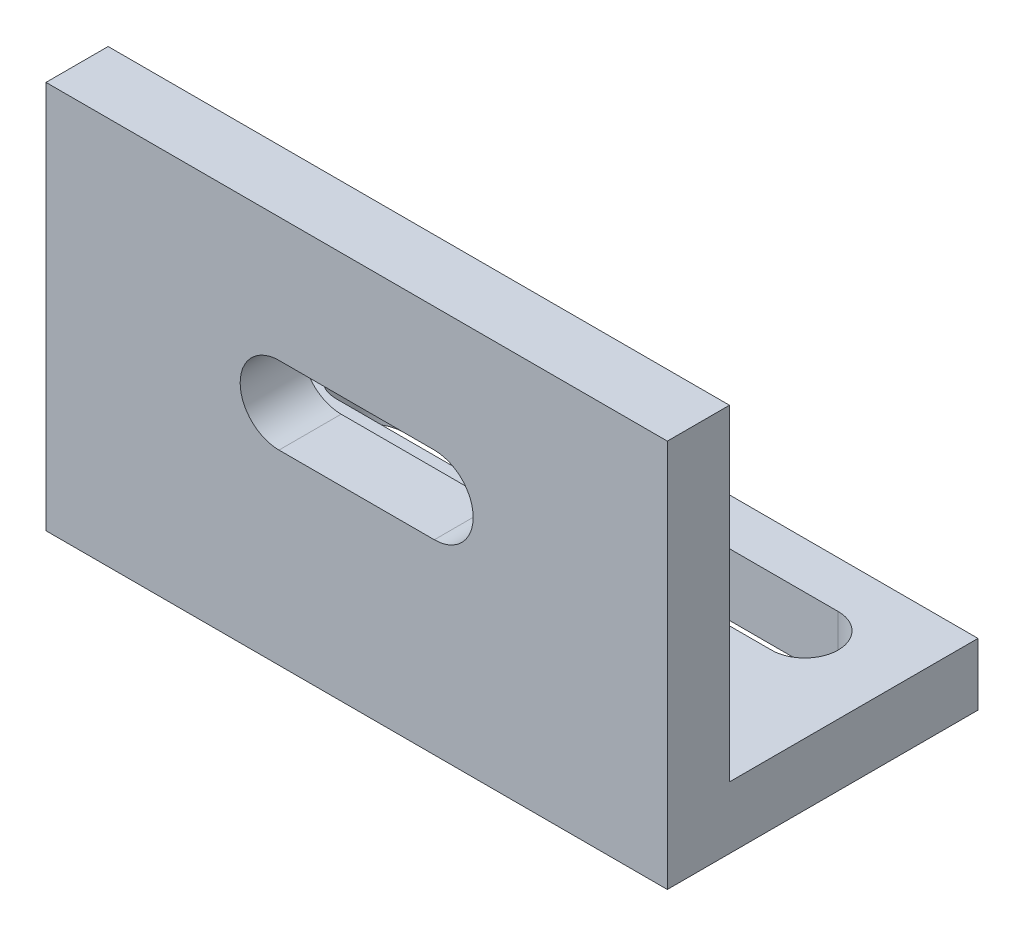
ISO-10303-21;
HEADER;
FILE_DESCRIPTION(('STEP AP214'),'2;1');
FILE_NAME('part.step','',(''),(''),'','','');
FILE_SCHEMA(('AUTOMOTIVE_DESIGN { 1 0 10303 214 1 1 1 1 }'));
ENDSEC;
DATA;
#1=APPLICATION_CONTEXT('core data for automotive mechanical design processes');
#2=APPLICATION_PROTOCOL_DEFINITION('international standard','automotive_design',2000,#1);
#3=PRODUCT_CONTEXT('',#1,'mechanical');
#4=PRODUCT('Part','Part','',(#3));
#5=PRODUCT_RELATED_PRODUCT_CATEGORY('part','',(#4));
#6=PRODUCT_DEFINITION_FORMATION('','',#4);
#7=PRODUCT_DEFINITION_CONTEXT('part definition',#1,'design');
#8=PRODUCT_DEFINITION('design','',#6,#7);
#9=PRODUCT_DEFINITION_SHAPE('','',#8);
#10=(LENGTH_UNIT() NAMED_UNIT(*) SI_UNIT(.MILLI.,.METRE.));
#11=(NAMED_UNIT(*) PLANE_ANGLE_UNIT() SI_UNIT($,.RADIAN.));
#12=(NAMED_UNIT(*) SI_UNIT($,.STERADIAN.) SOLID_ANGLE_UNIT());
#13=UNCERTAINTY_MEASURE_WITH_UNIT(LENGTH_MEASURE(1.E-05),#10,'distance_accuracy_value','');
#14=(GEOMETRIC_REPRESENTATION_CONTEXT(3) GLOBAL_UNCERTAINTY_ASSIGNED_CONTEXT((#13)) GLOBAL_UNIT_ASSIGNED_CONTEXT((#10,
#11,#12)) REPRESENTATION_CONTEXT('',''));
#15=CARTESIAN_POINT('',(0.,0.,0.));
#16=DIRECTION('',(0.,0.,1.));
#17=DIRECTION('',(1.,0.,0.));
#18=AXIS2_PLACEMENT_3D('',#15,#16,#17);
#19=CARTESIAN_POINT('',(-49.2592592592593,4.,0.));
#20=DIRECTION('',(1.,0.,0.));
#21=DIRECTION('',(0.,0.,-1.));
#22=AXIS2_PLACEMENT_3D('',#19,#20,#21);
#23=PLANE('',#22);
#24=DIRECTION('',(0.,0.,1.));
#25=VECTOR('',#24,1.);
#26=CARTESIAN_POINT('',(-49.2592592592593,0.,0.));
#27=LINE('',#26,#25);
#28=CARTESIAN_POINT('',(-49.2592592592593,0.,-12.8888888888889));
#29=VERTEX_POINT('',#28);
#30=CARTESIAN_POINT('',(-49.2592592592593,0.,7.1111111111111));
#31=VERTEX_POINT('',#30);
#32=EDGE_CURVE('E211',#29,#31,#27,.T.);
#33=ORIENTED_EDGE('',*,*,#32,.T.);
#34=DIRECTION('',(0.,-1.,0.));
#35=VECTOR('',#34,1.);
#36=CARTESIAN_POINT('',(-49.2592592592593,4.,7.1111111111111));
#37=LINE('',#36,#35);
#38=CARTESIAN_POINT('',(-49.2592592592593,25.,7.1111111111111));
#39=VERTEX_POINT('',#38);
#40=EDGE_CURVE('E237',#39,#31,#37,.T.);
#41=ORIENTED_EDGE('',*,*,#40,.F.);
#42=DIRECTION('',(0.,0.,1.));
#43=VECTOR('',#42,1.);
#44=CARTESIAN_POINT('',(-49.2592592592593,25.,7.1111111111111));
#45=LINE('',#44,#43);
#46=CARTESIAN_POINT('',(-49.2592592592593,25.,3.1111111111111));
#47=VERTEX_POINT('',#46);
#48=EDGE_CURVE('E193',#47,#39,#45,.T.);
#49=ORIENTED_EDGE('',*,*,#48,.F.);
#50=DIRECTION('',(0.,-1.,0.));
#51=VECTOR('',#50,1.);
#52=CARTESIAN_POINT('',(-49.2592592592593,25.,3.1111111111111));
#53=LINE('',#52,#51);
#54=CARTESIAN_POINT('',(-49.2592592592593,4.,3.1111111111111));
#55=VERTEX_POINT('',#54);
#56=EDGE_CURVE('E203',#47,#55,#53,.T.);
#57=ORIENTED_EDGE('',*,*,#56,.T.);
#58=DIRECTION('',(0.,0.,1.));
#59=VECTOR('',#58,1.);
#60=CARTESIAN_POINT('',(-49.2592592592593,4.,0.));
#61=LINE('',#60,#59);
#62=CARTESIAN_POINT('',(-49.2592592592593,4.,-12.8888888888889));
#63=VERTEX_POINT('',#62);
#64=EDGE_CURVE('E212',#63,#55,#61,.T.);
#65=ORIENTED_EDGE('',*,*,#64,.F.);
#66=DIRECTION('',(0.,-1.,0.));
#67=VECTOR('',#66,1.);
#68=CARTESIAN_POINT('',(-49.2592592592593,4.,-12.8888888888889));
#69=LINE('',#68,#67);
#70=EDGE_CURVE('E221',#63,#29,#69,.T.);
#71=ORIENTED_EDGE('',*,*,#70,.T.);
#72=EDGE_LOOP('',(#33,#41,#49,#57,#65,#71));
#73=FACE_BOUND('',#72,.T.);
#74=ADVANCED_FACE('F35',(#73),#23,.F.);
#75=CARTESIAN_POINT('',(0.,4.,7.1111111111111));
#76=DIRECTION('',(0.,0.,-1.));
#77=DIRECTION('',(-1.,0.,0.));
#78=AXIS2_PLACEMENT_3D('',#75,#76,#77);
#79=PLANE('',#78);
#80=DIRECTION('',(1.,0.,0.));
#81=VECTOR('',#80,1.);
#82=CARTESIAN_POINT('',(0.,17.,7.1111111111111));
#83=LINE('',#82,#81);
#84=CARTESIAN_POINT('',(-34.2592592592593,17.,7.1111111111111));
#85=VERTEX_POINT('',#84);
#86=CARTESIAN_POINT('',(-24.2592592592593,17.,7.1111111111111));
#87=VERTEX_POINT('',#86);
#88=EDGE_CURVE('E166',#85,#87,#83,.T.);
#89=ORIENTED_EDGE('',*,*,#88,.T.);
#90=CARTESIAN_POINT('',(-24.2592592592593,14.5,7.1111111111111));
#91=DIRECTION('',(0.,0.,-1.));
#92=DIRECTION('',(-1.,0.,0.));
#93=AXIS2_PLACEMENT_3D('',#90,#91,#92);
#94=CIRCLE('',#93,2.5);
#95=CARTESIAN_POINT('',(-24.2592592592593,12.,7.1111111111111));
#96=VERTEX_POINT('',#95);
#97=EDGE_CURVE('E169',#87,#96,#94,.T.);
#98=ORIENTED_EDGE('',*,*,#97,.T.);
#99=DIRECTION('',(-1.,0.,0.));
#100=VECTOR('',#99,1.);
#101=CARTESIAN_POINT('',(0.,12.,7.1111111111111));
#102=LINE('',#101,#100);
#103=CARTESIAN_POINT('',(-34.2592592592593,12.,7.1111111111111));
#104=VERTEX_POINT('',#103);
#105=EDGE_CURVE('E161',#96,#104,#102,.T.);
#106=ORIENTED_EDGE('',*,*,#105,.T.);
#107=CARTESIAN_POINT('',(-34.2592592592593,14.5,7.1111111111111));
#108=DIRECTION('',(0.,0.,-1.));
#109=DIRECTION('',(-1.,0.,0.));
#110=AXIS2_PLACEMENT_3D('',#107,#108,#109);
#111=CIRCLE('',#110,2.5);
#112=EDGE_CURVE('E141',#104,#85,#111,.T.);
#113=ORIENTED_EDGE('',*,*,#112,.T.);
#114=EDGE_LOOP('',(#89,#98,#106,#113));
#115=FACE_BOUND('',#114,.T.);
#116=DIRECTION('',(1.,0.,0.));
#117=VECTOR('',#116,1.);
#118=CARTESIAN_POINT('',(0.,0.,7.1111111111111));
#119=LINE('',#118,#117);
#120=CARTESIAN_POINT('',(-9.25925925925926,0.,7.1111111111111));
#121=VERTEX_POINT('',#120);
#122=EDGE_CURVE('E224',#31,#121,#119,.T.);
#123=ORIENTED_EDGE('',*,*,#122,.T.);
#124=DIRECTION('',(0.,-1.,0.));
#125=VECTOR('',#124,1.);
#126=CARTESIAN_POINT('',(-9.25925925925926,4.,7.1111111111111));
#127=LINE('',#126,#125);
#128=CARTESIAN_POINT('',(-9.25925925925926,25.,7.1111111111111));
#129=VERTEX_POINT('',#128);
#130=EDGE_CURVE('E235',#129,#121,#127,.T.);
#131=ORIENTED_EDGE('',*,*,#130,.F.);
#132=DIRECTION('',(1.,0.,0.));
#133=VECTOR('',#132,1.);
#134=CARTESIAN_POINT('',(-49.2592592592593,25.,7.1111111111111));
#135=LINE('',#134,#133);
#136=EDGE_CURVE('E196',#39,#129,#135,.T.);
#137=ORIENTED_EDGE('',*,*,#136,.F.);
#138=ORIENTED_EDGE('',*,*,#40,.T.);
#139=EDGE_LOOP('',(#123,#131,#137,#138));
#140=FACE_BOUND('',#139,.T.);
#141=ADVANCED_FACE('F280',(#115,#140),#79,.F.);
#142=CARTESIAN_POINT('',(-9.25925925925926,4.,0.));
#143=DIRECTION('',(1.,0.,0.));
#144=DIRECTION('',(0.,0.,-1.));
#145=AXIS2_PLACEMENT_3D('',#142,#143,#144);
#146=PLANE('',#145);
#147=DIRECTION('',(0.,0.,1.));
#148=VECTOR('',#147,1.);
#149=CARTESIAN_POINT('',(-9.25925925925926,0.,0.));
#150=LINE('',#149,#148);
#151=CARTESIAN_POINT('',(-9.25925925925926,0.,-12.8888888888889));
#152=VERTEX_POINT('',#151);
#153=EDGE_CURVE('E227',#152,#121,#150,.T.);
#154=ORIENTED_EDGE('',*,*,#153,.F.);
#155=DIRECTION('',(0.,-1.,0.));
#156=VECTOR('',#155,1.);
#157=CARTESIAN_POINT('',(-9.25925925925926,4.,-12.8888888888889));
#158=LINE('',#157,#156);
#159=CARTESIAN_POINT('',(-9.25925925925926,4.,-12.8888888888889));
#160=VERTEX_POINT('',#159);
#161=EDGE_CURVE('E233',#160,#152,#158,.T.);
#162=ORIENTED_EDGE('',*,*,#161,.F.);
#163=DIRECTION('',(0.,0.,1.));
#164=VECTOR('',#163,1.);
#165=CARTESIAN_POINT('',(-9.25925925925926,4.,0.));
#166=LINE('',#165,#164);
#167=CARTESIAN_POINT('',(-9.25925925925926,4.,3.1111111111111));
#168=VERTEX_POINT('',#167);
#169=EDGE_CURVE('E214',#160,#168,#166,.T.);
#170=ORIENTED_EDGE('',*,*,#169,.T.);
#171=DIRECTION('',(0.,-1.,0.));
#172=VECTOR('',#171,1.);
#173=CARTESIAN_POINT('',(-9.25925925925926,25.,3.1111111111111));
#174=LINE('',#173,#172);
#175=CARTESIAN_POINT('',(-9.25925925925926,25.,3.1111111111111));
#176=VERTEX_POINT('',#175);
#177=EDGE_CURVE('E208',#176,#168,#174,.T.);
#178=ORIENTED_EDGE('',*,*,#177,.F.);
#179=DIRECTION('',(0.,0.,-1.));
#180=VECTOR('',#179,1.);
#181=CARTESIAN_POINT('',(-9.25925925925926,25.,7.1111111111111));
#182=LINE('',#181,#180);
#183=EDGE_CURVE('E199',#129,#176,#182,.T.);
#184=ORIENTED_EDGE('',*,*,#183,.F.);
#185=ORIENTED_EDGE('',*,*,#130,.T.);
#186=EDGE_LOOP('',(#154,#162,#170,#178,#184,#185));
#187=FACE_BOUND('',#186,.T.);
#188=ADVANCED_FACE('F285',(#187),#146,.T.);
#189=CARTESIAN_POINT('',(0.,4.,-12.8888888888889));
#190=DIRECTION('',(0.,0.,-1.));
#191=DIRECTION('',(-1.,0.,0.));
#192=AXIS2_PLACEMENT_3D('',#189,#190,#191);
#193=PLANE('',#192);
#194=DIRECTION('',(1.,0.,0.));
#195=VECTOR('',#194,1.);
#196=CARTESIAN_POINT('',(0.,0.,-12.8888888888889));
#197=LINE('',#196,#195);
#198=EDGE_CURVE('E215',#29,#152,#197,.T.);
#199=ORIENTED_EDGE('',*,*,#198,.F.);
#200=ORIENTED_EDGE('',*,*,#70,.F.);
#201=DIRECTION('',(1.,0.,0.));
#202=VECTOR('',#201,1.);
#203=CARTESIAN_POINT('',(0.,4.,-12.8888888888889));
#204=LINE('',#203,#202);
#205=EDGE_CURVE('E218',#63,#160,#204,.T.);
#206=ORIENTED_EDGE('',*,*,#205,.T.);
#207=ORIENTED_EDGE('',*,*,#161,.T.);
#208=EDGE_LOOP('',(#199,#200,#206,#207));
#209=FACE_BOUND('',#208,.T.);
#210=ADVANCED_FACE('F293',(#209),#193,.T.);
#211=CARTESIAN_POINT('',(0.,4.,0.));
#212=DIRECTION('',(0.,1.,0.));
#213=DIRECTION('',(0.,0.,1.));
#214=AXIS2_PLACEMENT_3D('',#211,#212,#213);
#215=PLANE('',#214);
#216=CARTESIAN_POINT('',(-15.2592592592593,4.,-7.73888888888891));
#217=DIRECTION('',(0.,1.,0.));
#218=DIRECTION('',(0.,0.,1.));
#219=AXIS2_PLACEMENT_3D('',#216,#217,#218);
#220=CIRCLE('',#219,2.15);
#221=CARTESIAN_POINT('',(-15.2592592592593,4.,-5.58888888888891));
#222=VERTEX_POINT('',#221);
#223=CARTESIAN_POINT('',(-15.2592592592593,4.,-9.8888888888889));
#224=VERTEX_POINT('',#223);
#225=EDGE_CURVE('E172',#222,#224,#220,.T.);
#226=ORIENTED_EDGE('',*,*,#225,.F.);
#227=DIRECTION('',(1.,0.,0.));
#228=VECTOR('',#227,1.);
#229=CARTESIAN_POINT('',(-15.2592592592593,4.,-5.58888888888891));
#230=LINE('',#229,#228);
#231=CARTESIAN_POINT('',(-43.2592592592593,4.,-5.58888888888891));
#232=VERTEX_POINT('',#231);
#233=EDGE_CURVE('E180',#232,#222,#230,.T.);
#234=ORIENTED_EDGE('',*,*,#233,.F.);
#235=CARTESIAN_POINT('',(-43.2592592592593,4.,-7.73888888888891));
#236=DIRECTION('',(0.,1.,0.));
#237=DIRECTION('',(0.,0.,1.));
#238=AXIS2_PLACEMENT_3D('',#235,#236,#237);
#239=CIRCLE('',#238,2.14999999999999);
#240=CARTESIAN_POINT('',(-43.2592592592593,4.,-9.8888888888889));
#241=VERTEX_POINT('',#240);
#242=EDGE_CURVE('E177',#241,#232,#239,.T.);
#243=ORIENTED_EDGE('',*,*,#242,.F.);
#244=DIRECTION('',(-1.,0.,0.));
#245=VECTOR('',#244,1.);
#246=CARTESIAN_POINT('',(-15.2592592592593,4.,-9.8888888888889));
#247=LINE('',#246,#245);
#248=EDGE_CURVE('E174',#224,#241,#247,.T.);
#249=ORIENTED_EDGE('',*,*,#248,.F.);
#250=EDGE_LOOP('',(#226,#234,#243,#249));
#251=FACE_BOUND('',#250,.T.);
#252=DIRECTION('',(-1.,0.,0.));
#253=VECTOR('',#252,1.);
#254=CARTESIAN_POINT('',(-49.2592592592593,4.,3.1111111111111));
#255=LINE('',#254,#253);
#256=EDGE_CURVE('E186',#168,#55,#255,.T.);
#257=ORIENTED_EDGE('',*,*,#256,.F.);
#258=ORIENTED_EDGE('',*,*,#169,.F.);
#259=ORIENTED_EDGE('',*,*,#205,.F.);
#260=ORIENTED_EDGE('',*,*,#64,.T.);
#261=EDGE_LOOP('',(#257,#258,#259,#260));
#262=FACE_BOUND('',#261,.T.);
#263=ADVANCED_FACE('F261',(#251,#262),#215,.T.);
#264=CARTESIAN_POINT('',(0.,0.,0.));
#265=DIRECTION('',(0.,1.,0.));
#266=DIRECTION('',(0.,0.,1.));
#267=AXIS2_PLACEMENT_3D('',#264,#265,#266);
#268=PLANE('',#267);
#269=DIRECTION('',(1.,0.,0.));
#270=VECTOR('',#269,1.);
#271=CARTESIAN_POINT('',(0.,0.,-5.58888888888891));
#272=LINE('',#271,#270);
#273=CARTESIAN_POINT('',(-43.2592592592593,0.,-5.58888888888891));
#274=VERTEX_POINT('',#273);
#275=CARTESIAN_POINT('',(-15.2592592592593,0.,-5.58888888888891));
#276=VERTEX_POINT('',#275);
#277=EDGE_CURVE('E42',#274,#276,#272,.T.);
#278=ORIENTED_EDGE('',*,*,#277,.T.);
#279=CARTESIAN_POINT('',(-15.2592592592593,0.,-7.73888888888891));
#280=DIRECTION('',(0.,1.,0.));
#281=DIRECTION('',(0.,0.,1.));
#282=AXIS2_PLACEMENT_3D('',#279,#280,#281);
#283=CIRCLE('',#282,2.15);
#284=CARTESIAN_POINT('',(-15.2592592592593,0.,-9.8888888888889));
#285=VERTEX_POINT('',#284);
#286=EDGE_CURVE('E11',#276,#285,#283,.T.);
#287=ORIENTED_EDGE('',*,*,#286,.T.);
#288=DIRECTION('',(-1.,0.,0.));
#289=VECTOR('',#288,1.);
#290=CARTESIAN_POINT('',(0.,0.,-9.88888888888891));
#291=LINE('',#290,#289);
#292=CARTESIAN_POINT('',(-43.2592592592593,0.,-9.8888888888889));
#293=VERTEX_POINT('',#292);
#294=EDGE_CURVE('E240',#285,#293,#291,.T.);
#295=ORIENTED_EDGE('',*,*,#294,.T.);
#296=CARTESIAN_POINT('',(-43.2592592592593,0.,-7.73888888888891));
#297=DIRECTION('',(0.,1.,0.));
#298=DIRECTION('',(0.,0.,1.));
#299=AXIS2_PLACEMENT_3D('',#296,#297,#298);
#300=CIRCLE('',#299,2.14999999999999);
#301=EDGE_CURVE('E243',#293,#274,#300,.T.);
#302=ORIENTED_EDGE('',*,*,#301,.T.);
#303=EDGE_LOOP('',(#278,#287,#295,#302));
#304=FACE_BOUND('',#303,.T.);
#305=ORIENTED_EDGE('',*,*,#32,.F.);
#306=ORIENTED_EDGE('',*,*,#198,.T.);
#307=ORIENTED_EDGE('',*,*,#153,.T.);
#308=ORIENTED_EDGE('',*,*,#122,.F.);
#309=EDGE_LOOP('',(#305,#306,#307,#308));
#310=FACE_BOUND('',#309,.T.);
#311=ADVANCED_FACE('F247',(#304,#310),#268,.F.);
#312=CARTESIAN_POINT('',(-49.2592592592593,25.,3.1111111111111));
#313=DIRECTION('',(0.,0.,1.));
#314=DIRECTION('',(1.,0.,0.));
#315=AXIS2_PLACEMENT_3D('',#312,#313,#314);
#316=PLANE('',#315);
#317=DIRECTION('',(-1.,0.,0.));
#318=VECTOR('',#317,1.);
#319=CARTESIAN_POINT('',(-24.2592592592593,12.,3.1111111111111));
#320=LINE('',#319,#318);
#321=CARTESIAN_POINT('',(-24.2592592592593,12.,3.1111111111111));
#322=VERTEX_POINT('',#321);
#323=CARTESIAN_POINT('',(-34.2592592592593,12.,3.1111111111111));
#324=VERTEX_POINT('',#323);
#325=EDGE_CURVE('E147',#322,#324,#320,.T.);
#326=ORIENTED_EDGE('',*,*,#325,.F.);
#327=CARTESIAN_POINT('',(-24.2592592592593,14.5,3.1111111111111));
#328=DIRECTION('',(0.,0.,-1.));
#329=DIRECTION('',(-1.,0.,0.));
#330=AXIS2_PLACEMENT_3D('',#327,#328,#329);
#331=CIRCLE('',#330,2.5);
#332=CARTESIAN_POINT('',(-24.2592592592593,17.,3.1111111111111));
#333=VERTEX_POINT('',#332);
#334=EDGE_CURVE('E57',#333,#322,#331,.T.);
#335=ORIENTED_EDGE('',*,*,#334,.F.);
#336=DIRECTION('',(1.,0.,0.));
#337=VECTOR('',#336,1.);
#338=CARTESIAN_POINT('',(-24.2592592592593,17.,3.1111111111111));
#339=LINE('',#338,#337);
#340=CARTESIAN_POINT('',(-34.2592592592593,17.,3.1111111111111));
#341=VERTEX_POINT('',#340);
#342=EDGE_CURVE('E154',#341,#333,#339,.T.);
#343=ORIENTED_EDGE('',*,*,#342,.F.);
#344=CARTESIAN_POINT('',(-34.2592592592593,14.5,3.1111111111111));
#345=DIRECTION('',(0.,0.,-1.));
#346=DIRECTION('',(-1.,0.,0.));
#347=AXIS2_PLACEMENT_3D('',#344,#345,#346);
#348=CIRCLE('',#347,2.5);
#349=EDGE_CURVE('E138',#324,#341,#348,.T.);
#350=ORIENTED_EDGE('',*,*,#349,.F.);
#351=EDGE_LOOP('',(#326,#335,#343,#350));
#352=FACE_BOUND('',#351,.T.);
#353=ORIENTED_EDGE('',*,*,#256,.T.);
#354=ORIENTED_EDGE('',*,*,#56,.F.);
#355=DIRECTION('',(-1.,0.,0.));
#356=VECTOR('',#355,1.);
#357=CARTESIAN_POINT('',(-49.2592592592593,25.,3.1111111111111));
#358=LINE('',#357,#356);
#359=EDGE_CURVE('E201',#176,#47,#358,.T.);
#360=ORIENTED_EDGE('',*,*,#359,.F.);
#361=ORIENTED_EDGE('',*,*,#177,.T.);
#362=EDGE_LOOP('',(#353,#354,#360,#361));
#363=FACE_BOUND('',#362,.T.);
#364=ADVANCED_FACE('F151',(#352,#363),#316,.F.);
#365=CARTESIAN_POINT('',(0.,25.,0.));
#366=DIRECTION('',(0.,-1.,0.));
#367=DIRECTION('',(0.,0.,-1.));
#368=AXIS2_PLACEMENT_3D('',#365,#366,#367);
#369=PLANE('',#368);
#370=ORIENTED_EDGE('',*,*,#48,.T.);
#371=ORIENTED_EDGE('',*,*,#136,.T.);
#372=ORIENTED_EDGE('',*,*,#183,.T.);
#373=ORIENTED_EDGE('',*,*,#359,.T.);
#374=EDGE_LOOP('',(#370,#371,#372,#373));
#375=FACE_BOUND('',#374,.T.);
#376=ADVANCED_FACE('F302',(#375),#369,.F.);
#377=CARTESIAN_POINT('',(-15.2592592592593,-6.,-7.73888888888891));
#378=DIRECTION('',(0.,1.,0.));
#379=DIRECTION('',(0.,0.,1.));
#380=AXIS2_PLACEMENT_3D('',#377,#378,#379);
#381=CYLINDRICAL_SURFACE('',#380,2.15);
#382=DIRECTION('',(0.,1.,0.));
#383=VECTOR('',#382,1.);
#384=CARTESIAN_POINT('',(-15.2592592592593,-6.,-5.58888888888891));
#385=LINE('',#384,#383);
#386=EDGE_CURVE('E184',#276,#222,#385,.T.);
#387=ORIENTED_EDGE('',*,*,#386,.T.);
#388=ORIENTED_EDGE('',*,*,#225,.T.);
#389=DIRECTION('',(0.,1.,0.));
#390=VECTOR('',#389,1.);
#391=CARTESIAN_POINT('',(-15.2592592592593,-6.,-9.8888888888889));
#392=LINE('',#391,#390);
#393=EDGE_CURVE('E183',#285,#224,#392,.T.);
#394=ORIENTED_EDGE('',*,*,#393,.F.);
#395=ORIENTED_EDGE('',*,*,#286,.F.);
#396=EDGE_LOOP('',(#387,#388,#394,#395));
#397=FACE_BOUND('',#396,.T.);
#398=ADVANCED_FACE('F265',(#397),#381,.F.);
#399=CARTESIAN_POINT('',(-15.2592592592593,-6.,-5.58888888888891));
#400=DIRECTION('',(0.,0.,1.));
#401=DIRECTION('',(1.,0.,0.));
#402=AXIS2_PLACEMENT_3D('',#399,#400,#401);
#403=PLANE('',#402);
#404=DIRECTION('',(0.,1.,0.));
#405=VECTOR('',#404,1.);
#406=CARTESIAN_POINT('',(-43.2592592592593,-6.,-5.58888888888891));
#407=LINE('',#406,#405);
#408=EDGE_CURVE('E187',#274,#232,#407,.T.);
#409=ORIENTED_EDGE('',*,*,#408,.T.);
#410=ORIENTED_EDGE('',*,*,#233,.T.);
#411=ORIENTED_EDGE('',*,*,#386,.F.);
#412=ORIENTED_EDGE('',*,*,#277,.F.);
#413=EDGE_LOOP('',(#409,#410,#411,#412));
#414=FACE_BOUND('',#413,.T.);
#415=ADVANCED_FACE('F253',(#414),#403,.F.);
#416=CARTESIAN_POINT('',(-43.2592592592593,-6.,-7.73888888888891));
#417=DIRECTION('',(0.,1.,0.));
#418=DIRECTION('',(0.,0.,1.));
#419=AXIS2_PLACEMENT_3D('',#416,#417,#418);
#420=CYLINDRICAL_SURFACE('',#419,2.14999999999999);
#421=DIRECTION('',(0.,1.,0.));
#422=VECTOR('',#421,1.);
#423=CARTESIAN_POINT('',(-43.2592592592593,-6.,-9.8888888888889));
#424=LINE('',#423,#422);
#425=EDGE_CURVE('E189',#293,#241,#424,.T.);
#426=ORIENTED_EDGE('',*,*,#425,.T.);
#427=ORIENTED_EDGE('',*,*,#242,.T.);
#428=ORIENTED_EDGE('',*,*,#408,.F.);
#429=ORIENTED_EDGE('',*,*,#301,.F.);
#430=EDGE_LOOP('',(#426,#427,#428,#429));
#431=FACE_BOUND('',#430,.T.);
#432=ADVANCED_FACE('F255',(#431),#420,.F.);
#433=CARTESIAN_POINT('',(-15.2592592592593,-6.,-9.8888888888889));
#434=DIRECTION('',(0.,0.,-1.));
#435=DIRECTION('',(-1.,0.,0.));
#436=AXIS2_PLACEMENT_3D('',#433,#434,#435);
#437=PLANE('',#436);
#438=ORIENTED_EDGE('',*,*,#393,.T.);
#439=ORIENTED_EDGE('',*,*,#248,.T.);
#440=ORIENTED_EDGE('',*,*,#425,.F.);
#441=ORIENTED_EDGE('',*,*,#294,.F.);
#442=EDGE_LOOP('',(#438,#439,#440,#441));
#443=FACE_BOUND('',#442,.T.);
#444=ADVANCED_FACE('F267',(#443),#437,.F.);
#445=CARTESIAN_POINT('',(-24.2592592592593,14.5,13.1111111111111));
#446=DIRECTION('',(0.,0.,-1.));
#447=DIRECTION('',(-1.,0.,0.));
#448=AXIS2_PLACEMENT_3D('',#445,#446,#447);
#449=CYLINDRICAL_SURFACE('',#448,2.5);
#450=DIRECTION('',(0.,0.,-1.));
#451=VECTOR('',#450,1.);
#452=CARTESIAN_POINT('',(-24.2592592592593,17.,13.1111111111111));
#453=LINE('',#452,#451);
#454=EDGE_CURVE('E159',#87,#333,#453,.T.);
#455=ORIENTED_EDGE('',*,*,#454,.T.);
#456=ORIENTED_EDGE('',*,*,#334,.T.);
#457=DIRECTION('',(0.,0.,-1.));
#458=VECTOR('',#457,1.);
#459=CARTESIAN_POINT('',(-24.2592592592593,12.,13.1111111111111));
#460=LINE('',#459,#458);
#461=EDGE_CURVE('E144',#96,#322,#460,.T.);
#462=ORIENTED_EDGE('',*,*,#461,.F.);
#463=ORIENTED_EDGE('',*,*,#97,.F.);
#464=EDGE_LOOP('',(#455,#456,#462,#463));
#465=FACE_BOUND('',#464,.T.);
#466=ADVANCED_FACE('F269',(#465),#449,.F.);
#467=CARTESIAN_POINT('',(-24.2592592592593,17.,13.1111111111111));
#468=DIRECTION('',(0.,1.,0.));
#469=DIRECTION('',(-1.,0.,0.));
#470=AXIS2_PLACEMENT_3D('',#467,#468,#469);
#471=PLANE('',#470);
#472=DIRECTION('',(0.,0.,-1.));
#473=VECTOR('',#472,1.);
#474=CARTESIAN_POINT('',(-34.2592592592593,17.,13.1111111111111));
#475=LINE('',#474,#473);
#476=EDGE_CURVE('E143',#85,#341,#475,.T.);
#477=ORIENTED_EDGE('',*,*,#476,.T.);
#478=ORIENTED_EDGE('',*,*,#342,.T.);
#479=ORIENTED_EDGE('',*,*,#454,.F.);
#480=ORIENTED_EDGE('',*,*,#88,.F.);
#481=EDGE_LOOP('',(#477,#478,#479,#480));
#482=FACE_BOUND('',#481,.T.);
#483=ADVANCED_FACE('F275',(#482),#471,.F.);
#484=CARTESIAN_POINT('',(-34.2592592592593,14.5,13.1111111111111));
#485=DIRECTION('',(0.,0.,-1.));
#486=DIRECTION('',(-1.,0.,0.));
#487=AXIS2_PLACEMENT_3D('',#484,#485,#486);
#488=CYLINDRICAL_SURFACE('',#487,2.5);
#489=DIRECTION('',(0.,0.,-1.));
#490=VECTOR('',#489,1.);
#491=CARTESIAN_POINT('',(-34.2592592592593,12.,13.1111111111111));
#492=LINE('',#491,#490);
#493=EDGE_CURVE('E49',#104,#324,#492,.T.);
#494=ORIENTED_EDGE('',*,*,#493,.T.);
#495=ORIENTED_EDGE('',*,*,#349,.T.);
#496=ORIENTED_EDGE('',*,*,#476,.F.);
#497=ORIENTED_EDGE('',*,*,#112,.F.);
#498=EDGE_LOOP('',(#494,#495,#496,#497));
#499=FACE_BOUND('',#498,.T.);
#500=ADVANCED_FACE('F135',(#499),#488,.F.);
#501=CARTESIAN_POINT('',(-24.2592592592593,12.,13.1111111111111));
#502=DIRECTION('',(0.,-1.,0.));
#503=DIRECTION('',(1.,0.,0.));
#504=AXIS2_PLACEMENT_3D('',#501,#502,#503);
#505=PLANE('',#504);
#506=ORIENTED_EDGE('',*,*,#461,.T.);
#507=ORIENTED_EDGE('',*,*,#325,.T.);
#508=ORIENTED_EDGE('',*,*,#493,.F.);
#509=ORIENTED_EDGE('',*,*,#105,.F.);
#510=EDGE_LOOP('',(#506,#507,#508,#509));
#511=FACE_BOUND('',#510,.T.);
#512=ADVANCED_FACE('F148',(#511),#505,.F.);
#513=CLOSED_SHELL('',(#74,#141,#188,#210,#263,#311,#364,#376,#398,#415,#432,#444,#466,#483,#500,#512));
#514=MANIFOLD_SOLID_BREP('B2',#513);
#515=ADVANCED_BREP_SHAPE_REPRESENTATION('',(#18,#514),#14);
#516=SHAPE_DEFINITION_REPRESENTATION(#9,#515);
ENDSEC;
END-ISO-10303-21;
